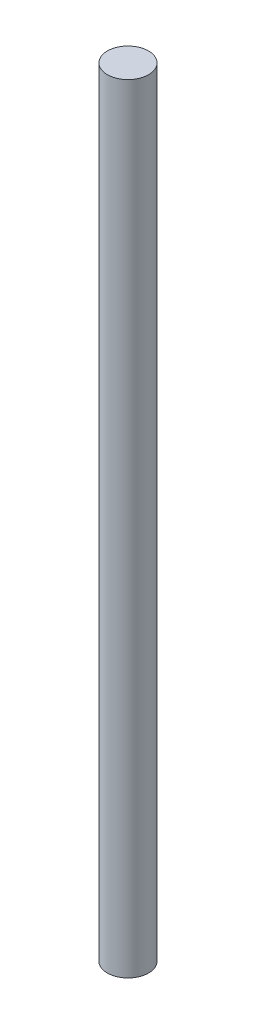
ISO-10303-21;
HEADER;
FILE_DESCRIPTION(('STEP AP214'),'2;1');
FILE_NAME('part.step','',(''),(''),'','','');
FILE_SCHEMA(('AUTOMOTIVE_DESIGN { 1 0 10303 214 1 1 1 1 }'));
ENDSEC;
DATA;
#1=APPLICATION_CONTEXT('core data for automotive mechanical design processes');
#2=APPLICATION_PROTOCOL_DEFINITION('international standard','automotive_design',2000,#1);
#3=PRODUCT_CONTEXT('',#1,'mechanical');
#4=PRODUCT('Part','Part','',(#3));
#5=PRODUCT_RELATED_PRODUCT_CATEGORY('part','',(#4));
#6=PRODUCT_DEFINITION_FORMATION('','',#4);
#7=PRODUCT_DEFINITION_CONTEXT('part definition',#1,'design');
#8=PRODUCT_DEFINITION('design','',#6,#7);
#9=PRODUCT_DEFINITION_SHAPE('','',#8);
#10=(LENGTH_UNIT() NAMED_UNIT(*) SI_UNIT(.MILLI.,.METRE.));
#11=(NAMED_UNIT(*) PLANE_ANGLE_UNIT() SI_UNIT($,.RADIAN.));
#12=(NAMED_UNIT(*) SI_UNIT($,.STERADIAN.) SOLID_ANGLE_UNIT());
#13=UNCERTAINTY_MEASURE_WITH_UNIT(LENGTH_MEASURE(1.E-05),#10,'distance_accuracy_value','');
#14=(GEOMETRIC_REPRESENTATION_CONTEXT(3) GLOBAL_UNCERTAINTY_ASSIGNED_CONTEXT((#13)) GLOBAL_UNIT_ASSIGNED_CONTEXT((#10,
#11,#12)) REPRESENTATION_CONTEXT('',''));
#15=CARTESIAN_POINT('',(0.,0.,0.));
#16=DIRECTION('',(0.,0.,1.));
#17=DIRECTION('',(1.,0.,0.));
#18=AXIS2_PLACEMENT_3D('',#15,#16,#17);
#19=CARTESIAN_POINT('',(0.,120.,0.));
#20=DIRECTION('',(0.,-1.,0.));
#21=DIRECTION('',(0.,0.,-1.));
#22=AXIS2_PLACEMENT_3D('',#19,#20,#21);
#23=CYLINDRICAL_SURFACE('',#22,6.35);
#24=CARTESIAN_POINT('',(0.,120.,0.));
#25=DIRECTION('',(0.,1.,0.));
#26=DIRECTION('',(0.,0.,1.));
#27=AXIS2_PLACEMENT_3D('',#24,#25,#26);
#28=CIRCLE('',#27,6.35);
#29=CARTESIAN_POINT('',(0.,120.,6.35));
#30=VERTEX_POINT('',#29);
#31=EDGE_CURVE('E10',#30,#30,#28,.T.);
#32=ORIENTED_EDGE('',*,*,#31,.F.);
#33=EDGE_LOOP('',(#32));
#34=FACE_BOUND('',#33,.T.);
#35=CARTESIAN_POINT('',(0.,-120.,0.));
#36=DIRECTION('',(0.,1.,0.));
#37=DIRECTION('',(0.,0.,1.));
#38=AXIS2_PLACEMENT_3D('',#35,#36,#37);
#39=CIRCLE('',#38,6.35);
#40=CARTESIAN_POINT('',(0.,-120.,6.35));
#41=VERTEX_POINT('',#40);
#42=EDGE_CURVE('E44',#41,#41,#39,.T.);
#43=ORIENTED_EDGE('',*,*,#42,.T.);
#44=EDGE_LOOP('',(#43));
#45=FACE_BOUND('',#44,.T.);
#46=ADVANCED_FACE('F41',(#34,#45),#23,.T.);
#47=CARTESIAN_POINT('',(0.,120.,0.));
#48=DIRECTION('',(0.,1.,0.));
#49=DIRECTION('',(0.,0.,1.));
#50=AXIS2_PLACEMENT_3D('',#47,#48,#49);
#51=PLANE('',#50);
#52=ORIENTED_EDGE('',*,*,#31,.T.);
#53=EDGE_LOOP('',(#52));
#54=FACE_BOUND('',#53,.T.);
#55=ADVANCED_FACE('F58',(#54),#51,.T.);
#56=CARTESIAN_POINT('',(0.,-120.,0.));
#57=DIRECTION('',(0.,1.,0.));
#58=DIRECTION('',(0.,0.,1.));
#59=AXIS2_PLACEMENT_3D('',#56,#57,#58);
#60=PLANE('',#59);
#61=ORIENTED_EDGE('',*,*,#42,.F.);
#62=EDGE_LOOP('',(#61));
#63=FACE_BOUND('',#62,.T.);
#64=ADVANCED_FACE('F56',(#63),#60,.F.);
#65=CLOSED_SHELL('',(#46,#55,#64));
#66=MANIFOLD_SOLID_BREP('B2',#65);
#67=ADVANCED_BREP_SHAPE_REPRESENTATION('',(#18,#66),#14);
#68=SHAPE_DEFINITION_REPRESENTATION(#9,#67);
ENDSEC;
END-ISO-10303-21;
